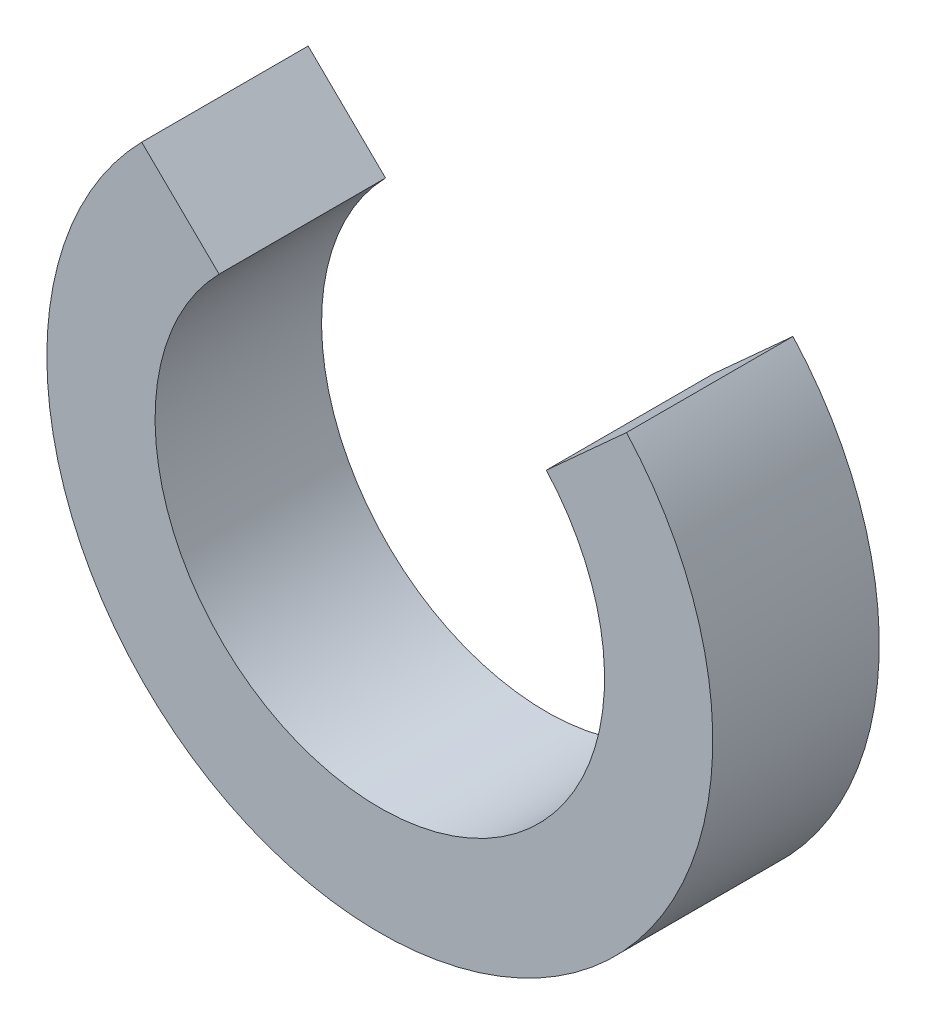
ISO-10303-21;
HEADER;
FILE_DESCRIPTION(('STEP AP214'),'2;1');
FILE_NAME('part.step','',(''),(''),'','','');
FILE_SCHEMA(('AUTOMOTIVE_DESIGN { 1 0 10303 214 1 1 1 1 }'));
ENDSEC;
DATA;
#1=APPLICATION_CONTEXT('core data for automotive mechanical design processes');
#2=APPLICATION_PROTOCOL_DEFINITION('international standard','automotive_design',2000,#1);
#3=PRODUCT_CONTEXT('',#1,'mechanical');
#4=PRODUCT('Part','Part','',(#3));
#5=PRODUCT_RELATED_PRODUCT_CATEGORY('part','',(#4));
#6=PRODUCT_DEFINITION_FORMATION('','',#4);
#7=PRODUCT_DEFINITION_CONTEXT('part definition',#1,'design');
#8=PRODUCT_DEFINITION('design','',#6,#7);
#9=PRODUCT_DEFINITION_SHAPE('','',#8);
#10=(LENGTH_UNIT() NAMED_UNIT(*) SI_UNIT(.MILLI.,.METRE.));
#11=(NAMED_UNIT(*) PLANE_ANGLE_UNIT() SI_UNIT($,.RADIAN.));
#12=(NAMED_UNIT(*) SI_UNIT($,.STERADIAN.) SOLID_ANGLE_UNIT());
#13=UNCERTAINTY_MEASURE_WITH_UNIT(LENGTH_MEASURE(1.E-05),#10,'distance_accuracy_value','');
#14=(GEOMETRIC_REPRESENTATION_CONTEXT(3) GLOBAL_UNCERTAINTY_ASSIGNED_CONTEXT((#13)) GLOBAL_UNIT_ASSIGNED_CONTEXT((#10,
#11,#12)) REPRESENTATION_CONTEXT('',''));
#15=CARTESIAN_POINT('',(0.,0.,0.));
#16=DIRECTION('',(0.,0.,1.));
#17=DIRECTION('',(1.,0.,0.));
#18=AXIS2_PLACEMENT_3D('',#15,#16,#17);
#19=CARTESIAN_POINT('',(0.,0.,20.));
#20=DIRECTION('',(0.,0.,1.));
#21=DIRECTION('',(1.,0.,0.));
#22=AXIS2_PLACEMENT_3D('',#19,#20,#21);
#23=PLANE('',#22);
#24=CARTESIAN_POINT('',(0.,0.,20.));
#25=DIRECTION('',(0.,0.,1.));
#26=DIRECTION('',(1.,0.,0.));
#27=AXIS2_PLACEMENT_3D('',#24,#25,#26);
#28=CIRCLE('',#27,40.);
#29=CARTESIAN_POINT('',(-28.6064363371066,27.9583940899878,20.));
#30=VERTEX_POINT('',#29);
#31=CARTESIAN_POINT('',(29.6346868898816,26.8660628477393,20.0000000000001));
#32=VERTEX_POINT('',#31);
#33=EDGE_CURVE('E85',#30,#32,#28,.T.);
#34=ORIENTED_EDGE('',*,*,#33,.T.);
#35=DIRECTION('',(-0.740867172247041,-0.671651571193483,0.));
#36=VECTOR('',#35,1.);
#37=CARTESIAN_POINT('',(0.,0.,20.));
#38=LINE('',#37,#36);
#39=CARTESIAN_POINT('',(20.0034136506701,18.134592422224,20.));
#40=VERTEX_POINT('',#39);
#41=EDGE_CURVE('E97',#32,#40,#38,.T.);
#42=ORIENTED_EDGE('',*,*,#41,.T.);
#43=CARTESIAN_POINT('',(0.,0.,20.));
#44=DIRECTION('',(0.,0.,1.));
#45=DIRECTION('',(1.,0.,0.));
#46=AXIS2_PLACEMENT_3D('',#43,#44,#45);
#47=CIRCLE('',#46,27.);
#48=CARTESIAN_POINT('',(-19.309344527547,18.8719160107418,20.));
#49=VERTEX_POINT('',#48);
#50=EDGE_CURVE('E87',#49,#40,#47,.T.);
#51=ORIENTED_EDGE('',*,*,#50,.F.);
#52=DIRECTION('',(-0.715160908427666,0.698959852249695,0.));
#53=VECTOR('',#52,1.);
#54=CARTESIAN_POINT('',(0.,0.,20.));
#55=LINE('',#54,#53);
#56=EDGE_CURVE('E55',#49,#30,#55,.T.);
#57=ORIENTED_EDGE('',*,*,#56,.T.);
#58=EDGE_LOOP('',(#34,#42,#51,#57));
#59=FACE_BOUND('',#58,.T.);
#60=ADVANCED_FACE('F33',(#59),#23,.T.);
#61=CARTESIAN_POINT('',(0.,0.,0.));
#62=DIRECTION('',(0.,0.,1.));
#63=DIRECTION('',(1.,0.,0.));
#64=AXIS2_PLACEMENT_3D('',#61,#62,#63);
#65=PLANE('',#64);
#66=DIRECTION('',(-0.740867172247041,-0.671651571193483,0.));
#67=VECTOR('',#66,1.);
#68=CARTESIAN_POINT('',(0.,0.,0.));
#69=LINE('',#68,#67);
#70=CARTESIAN_POINT('',(29.6346868898816,26.8660628477393,1.11022302462516E-13));
#71=VERTEX_POINT('',#70);
#72=CARTESIAN_POINT('',(20.0034136506701,18.134592422224,0.));
#73=VERTEX_POINT('',#72);
#74=EDGE_CURVE('E48',#71,#73,#69,.T.);
#75=ORIENTED_EDGE('',*,*,#74,.F.);
#76=CARTESIAN_POINT('',(0.,0.,0.));
#77=DIRECTION('',(0.,0.,1.));
#78=DIRECTION('',(1.,0.,0.));
#79=AXIS2_PLACEMENT_3D('',#76,#77,#78);
#80=CIRCLE('',#79,40.);
#81=CARTESIAN_POINT('',(-28.6064363371066,27.9583940899878,0.));
#82=VERTEX_POINT('',#81);
#83=EDGE_CURVE('E90',#82,#71,#80,.T.);
#84=ORIENTED_EDGE('',*,*,#83,.F.);
#85=DIRECTION('',(-0.715160908427666,0.698959852249695,0.));
#86=VECTOR('',#85,1.);
#87=CARTESIAN_POINT('',(0.,0.,0.));
#88=LINE('',#87,#86);
#89=CARTESIAN_POINT('',(-19.309344527547,18.8719160107418,0.));
#90=VERTEX_POINT('',#89);
#91=EDGE_CURVE('E74',#90,#82,#88,.T.);
#92=ORIENTED_EDGE('',*,*,#91,.F.);
#93=CARTESIAN_POINT('',(0.,0.,0.));
#94=DIRECTION('',(0.,0.,1.));
#95=DIRECTION('',(1.,0.,0.));
#96=AXIS2_PLACEMENT_3D('',#93,#94,#95);
#97=CIRCLE('',#96,27.);
#98=EDGE_CURVE('E94',#90,#73,#97,.T.);
#99=ORIENTED_EDGE('',*,*,#98,.T.);
#100=EDGE_LOOP('',(#75,#84,#92,#99));
#101=FACE_BOUND('',#100,.T.);
#102=ADVANCED_FACE('F104',(#101),#65,.F.);
#103=CARTESIAN_POINT('',(0.,0.,20.));
#104=DIRECTION('',(0.,0.,-1.));
#105=DIRECTION('',(-1.,0.,0.));
#106=AXIS2_PLACEMENT_3D('',#103,#104,#105);
#107=CYLINDRICAL_SURFACE('',#106,40.);
#108=DIRECTION('',(0.,0.,-1.));
#109=VECTOR('',#108,1.);
#110=CARTESIAN_POINT('',(29.6346868898816,26.8660628477393,168.614066163451));
#111=LINE('',#110,#109);
#112=EDGE_CURVE('E79',#32,#71,#111,.T.);
#113=ORIENTED_EDGE('',*,*,#112,.F.);
#114=ORIENTED_EDGE('',*,*,#33,.F.);
#115=DIRECTION('',(0.,0.,-1.));
#116=VECTOR('',#115,1.);
#117=CARTESIAN_POINT('',(-28.6064363371066,27.9583940899878,168.614066163451));
#118=LINE('',#117,#116);
#119=EDGE_CURVE('E71',#30,#82,#118,.T.);
#120=ORIENTED_EDGE('',*,*,#119,.T.);
#121=ORIENTED_EDGE('',*,*,#83,.T.);
#122=EDGE_LOOP('',(#113,#114,#120,#121));
#123=FACE_BOUND('',#122,.T.);
#124=ADVANCED_FACE('F35',(#123),#107,.T.);
#125=CARTESIAN_POINT('',(0.,0.,20.));
#126=DIRECTION('',(0.,0.,-1.));
#127=DIRECTION('',(-1.,0.,0.));
#128=AXIS2_PLACEMENT_3D('',#125,#126,#127);
#129=CYLINDRICAL_SURFACE('',#128,27.);
#130=ORIENTED_EDGE('',*,*,#50,.T.);
#131=DIRECTION('',(0.,0.,-1.));
#132=VECTOR('',#131,1.);
#133=CARTESIAN_POINT('',(20.0034136506701,18.134592422224,20.));
#134=LINE('',#133,#132);
#135=EDGE_CURVE('E11',#40,#73,#134,.T.);
#136=ORIENTED_EDGE('',*,*,#135,.T.);
#137=ORIENTED_EDGE('',*,*,#98,.F.);
#138=DIRECTION('',(0.,0.,-1.));
#139=VECTOR('',#138,1.);
#140=CARTESIAN_POINT('',(-19.309344527547,18.8719160107418,20.));
#141=LINE('',#140,#139);
#142=EDGE_CURVE('E41',#90,#49,#141,.F.);
#143=ORIENTED_EDGE('',*,*,#142,.T.);
#144=EDGE_LOOP('',(#130,#136,#137,#143));
#145=FACE_BOUND('',#144,.T.);
#146=ADVANCED_FACE('F107',(#145),#129,.F.);
#147=CARTESIAN_POINT('',(-19.309344527547,18.8719160107418,168.614066163451));
#148=DIRECTION('',(0.698959852249695,0.715160908427666,0.));
#149=DIRECTION('',(-0.715160908427666,0.698959852249695,0.));
#150=AXIS2_PLACEMENT_3D('',#147,#148,#149);
#151=PLANE('',#150);
#152=ORIENTED_EDGE('',*,*,#56,.F.);
#153=ORIENTED_EDGE('',*,*,#142,.F.);
#154=ORIENTED_EDGE('',*,*,#91,.T.);
#155=ORIENTED_EDGE('',*,*,#119,.F.);
#156=EDGE_LOOP('',(#152,#153,#154,#155));
#157=FACE_BOUND('',#156,.T.);
#158=ADVANCED_FACE('F72',(#157),#151,.T.);
#159=CARTESIAN_POINT('',(20.0034136506701,18.134592422224,168.614066163451));
#160=DIRECTION('',(-0.671651571193483,0.740867172247041,0.));
#161=DIRECTION('',(-0.740867172247041,-0.671651571193483,0.));
#162=AXIS2_PLACEMENT_3D('',#159,#160,#161);
#163=PLANE('',#162);
#164=ORIENTED_EDGE('',*,*,#41,.F.);
#165=ORIENTED_EDGE('',*,*,#112,.T.);
#166=ORIENTED_EDGE('',*,*,#74,.T.);
#167=ORIENTED_EDGE('',*,*,#135,.F.);
#168=EDGE_LOOP('',(#164,#165,#166,#167));
#169=FACE_BOUND('',#168,.T.);
#170=ADVANCED_FACE('F102',(#169),#163,.T.);
#171=CLOSED_SHELL('',(#60,#102,#124,#146,#158,#170));
#172=MANIFOLD_SOLID_BREP('B2',#171);
#173=ADVANCED_BREP_SHAPE_REPRESENTATION('',(#18,#172),#14);
#174=SHAPE_DEFINITION_REPRESENTATION(#9,#173);
ENDSEC;
END-ISO-10303-21;
